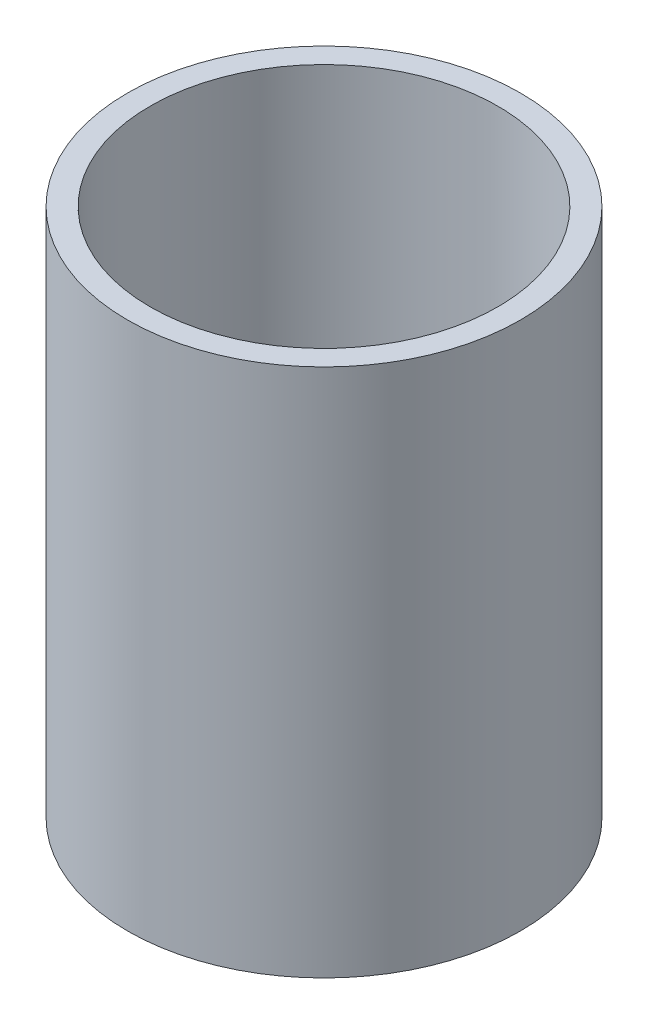
ISO-10303-21;
HEADER;
FILE_DESCRIPTION(('STEP AP214'),'2;1');
FILE_NAME('part.step','',(''),(''),'','','');
FILE_SCHEMA(('AUTOMOTIVE_DESIGN { 1 0 10303 214 1 1 1 1 }'));
ENDSEC;
DATA;
#1=APPLICATION_CONTEXT('core data for automotive mechanical design processes');
#2=APPLICATION_PROTOCOL_DEFINITION('international standard','automotive_design',2000,#1);
#3=PRODUCT_CONTEXT('',#1,'mechanical');
#4=PRODUCT('Part','Part','',(#3));
#5=PRODUCT_RELATED_PRODUCT_CATEGORY('part','',(#4));
#6=PRODUCT_DEFINITION_FORMATION('','',#4);
#7=PRODUCT_DEFINITION_CONTEXT('part definition',#1,'design');
#8=PRODUCT_DEFINITION('design','',#6,#7);
#9=PRODUCT_DEFINITION_SHAPE('','',#8);
#10=(LENGTH_UNIT() NAMED_UNIT(*) SI_UNIT(.MILLI.,.METRE.));
#11=(NAMED_UNIT(*) PLANE_ANGLE_UNIT() SI_UNIT($,.RADIAN.));
#12=(NAMED_UNIT(*) SI_UNIT($,.STERADIAN.) SOLID_ANGLE_UNIT());
#13=UNCERTAINTY_MEASURE_WITH_UNIT(LENGTH_MEASURE(1.E-05),#10,'distance_accuracy_value','');
#14=(GEOMETRIC_REPRESENTATION_CONTEXT(3) GLOBAL_UNCERTAINTY_ASSIGNED_CONTEXT((#13)) GLOBAL_UNIT_ASSIGNED_CONTEXT((#10,
#11,#12)) REPRESENTATION_CONTEXT('',''));
#15=CARTESIAN_POINT('',(0.,0.,0.));
#16=DIRECTION('',(0.,0.,1.));
#17=DIRECTION('',(1.,0.,0.));
#18=AXIS2_PLACEMENT_3D('',#15,#16,#17);
#19=CARTESIAN_POINT('',(0.,35.,0.));
#20=DIRECTION('',(0.,1.,0.));
#21=DIRECTION('',(0.,0.,1.));
#22=AXIS2_PLACEMENT_3D('',#19,#20,#21);
#23=PLANE('',#22);
#24=CARTESIAN_POINT('',(0.,35.,0.));
#25=DIRECTION('',(0.,1.,0.));
#26=DIRECTION('',(0.,0.,1.));
#27=AXIS2_PLACEMENT_3D('',#24,#25,#26);
#28=CIRCLE('',#27,26.);
#29=CARTESIAN_POINT('',(0.,35.,26.));
#30=VERTEX_POINT('',#29);
#31=EDGE_CURVE('E10',#30,#30,#28,.T.);
#32=ORIENTED_EDGE('',*,*,#31,.T.);
#33=EDGE_LOOP('',(#32));
#34=FACE_BOUND('',#33,.T.);
#35=CARTESIAN_POINT('',(0.,35.,0.));
#36=DIRECTION('',(0.,1.,0.));
#37=DIRECTION('',(0.,0.,1.));
#38=AXIS2_PLACEMENT_3D('',#35,#36,#37);
#39=CIRCLE('',#38,23.);
#40=CARTESIAN_POINT('',(0.,35.,23.));
#41=VERTEX_POINT('',#40);
#42=EDGE_CURVE('E41',#41,#41,#39,.T.);
#43=ORIENTED_EDGE('',*,*,#42,.F.);
#44=EDGE_LOOP('',(#43));
#45=FACE_BOUND('',#44,.T.);
#46=ADVANCED_FACE('F30',(#34,#45),#23,.T.);
#47=CARTESIAN_POINT('',(0.,-35.,0.));
#48=DIRECTION('',(0.,1.,0.));
#49=DIRECTION('',(0.,0.,1.));
#50=AXIS2_PLACEMENT_3D('',#47,#48,#49);
#51=PLANE('',#50);
#52=CARTESIAN_POINT('',(0.,-35.,0.));
#53=DIRECTION('',(0.,1.,0.));
#54=DIRECTION('',(0.,0.,1.));
#55=AXIS2_PLACEMENT_3D('',#52,#53,#54);
#56=CIRCLE('',#55,26.);
#57=CARTESIAN_POINT('',(0.,-35.,26.));
#58=VERTEX_POINT('',#57);
#59=EDGE_CURVE('E34',#58,#58,#56,.T.);
#60=ORIENTED_EDGE('',*,*,#59,.F.);
#61=EDGE_LOOP('',(#60));
#62=FACE_BOUND('',#61,.T.);
#63=CARTESIAN_POINT('',(0.,-35.,0.));
#64=DIRECTION('',(0.,1.,0.));
#65=DIRECTION('',(0.,0.,1.));
#66=AXIS2_PLACEMENT_3D('',#63,#64,#65);
#67=CIRCLE('',#66,23.);
#68=CARTESIAN_POINT('',(0.,-35.,23.));
#69=VERTEX_POINT('',#68);
#70=EDGE_CURVE('E43',#69,#69,#67,.T.);
#71=ORIENTED_EDGE('',*,*,#70,.T.);
#72=EDGE_LOOP('',(#71));
#73=FACE_BOUND('',#72,.T.);
#74=ADVANCED_FACE('F53',(#62,#73),#51,.F.);
#75=CARTESIAN_POINT('',(0.,35.,0.));
#76=DIRECTION('',(0.,-1.,0.));
#77=DIRECTION('',(0.,0.,-1.));
#78=AXIS2_PLACEMENT_3D('',#75,#76,#77);
#79=CYLINDRICAL_SURFACE('',#78,26.);
#80=ORIENTED_EDGE('',*,*,#31,.F.);
#81=EDGE_LOOP('',(#80));
#82=FACE_BOUND('',#81,.T.);
#83=ORIENTED_EDGE('',*,*,#59,.T.);
#84=EDGE_LOOP('',(#83));
#85=FACE_BOUND('',#84,.T.);
#86=ADVANCED_FACE('F32',(#82,#85),#79,.T.);
#87=CARTESIAN_POINT('',(0.,35.,0.));
#88=DIRECTION('',(0.,-1.,0.));
#89=DIRECTION('',(0.,0.,-1.));
#90=AXIS2_PLACEMENT_3D('',#87,#88,#89);
#91=CYLINDRICAL_SURFACE('',#90,23.);
#92=ORIENTED_EDGE('',*,*,#42,.T.);
#93=EDGE_LOOP('',(#92));
#94=FACE_BOUND('',#93,.T.);
#95=ORIENTED_EDGE('',*,*,#70,.F.);
#96=EDGE_LOOP('',(#95));
#97=FACE_BOUND('',#96,.T.);
#98=ADVANCED_FACE('F49',(#94,#97),#91,.F.);
#99=CLOSED_SHELL('',(#46,#74,#86,#98));
#100=MANIFOLD_SOLID_BREP('B2',#99);
#101=ADVANCED_BREP_SHAPE_REPRESENTATION('',(#18,#100),#14);
#102=SHAPE_DEFINITION_REPRESENTATION(#9,#101);
ENDSEC;
END-ISO-10303-21;
